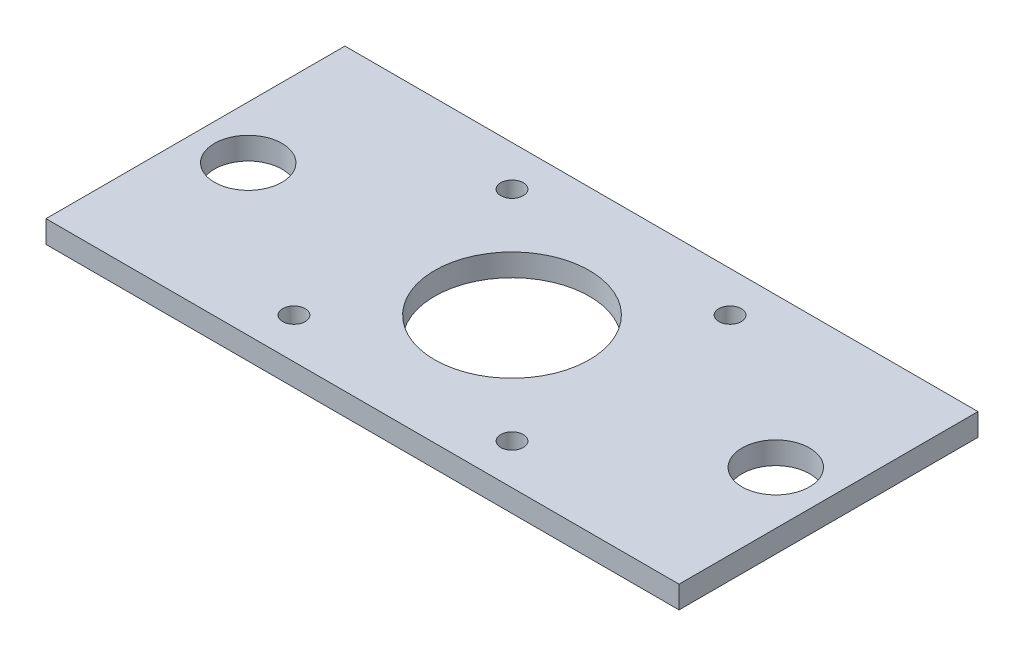
ISO-10303-21;
HEADER;
FILE_DESCRIPTION(('STEP AP214'),'2;1');
FILE_NAME('part.step','',(''),(''),'','','');
FILE_SCHEMA(('AUTOMOTIVE_DESIGN { 1 0 10303 214 1 1 1 1 }'));
ENDSEC;
DATA;
#1=APPLICATION_CONTEXT('core data for automotive mechanical design processes');
#2=APPLICATION_PROTOCOL_DEFINITION('international standard','automotive_design',2000,#1);
#3=PRODUCT_CONTEXT('',#1,'mechanical');
#4=PRODUCT('Part','Part','',(#3));
#5=PRODUCT_RELATED_PRODUCT_CATEGORY('part','',(#4));
#6=PRODUCT_DEFINITION_FORMATION('','',#4);
#7=PRODUCT_DEFINITION_CONTEXT('part definition',#1,'design');
#8=PRODUCT_DEFINITION('design','',#6,#7);
#9=PRODUCT_DEFINITION_SHAPE('','',#8);
#10=(LENGTH_UNIT() NAMED_UNIT(*) SI_UNIT(.MILLI.,.METRE.));
#11=(NAMED_UNIT(*) PLANE_ANGLE_UNIT() SI_UNIT($,.RADIAN.));
#12=(NAMED_UNIT(*) SI_UNIT($,.STERADIAN.) SOLID_ANGLE_UNIT());
#13=UNCERTAINTY_MEASURE_WITH_UNIT(LENGTH_MEASURE(1.E-05),#10,'distance_accuracy_value','');
#14=(GEOMETRIC_REPRESENTATION_CONTEXT(3) GLOBAL_UNCERTAINTY_ASSIGNED_CONTEXT((#13)) GLOBAL_UNIT_ASSIGNED_CONTEXT((#10,
#11,#12)) REPRESENTATION_CONTEXT('',''));
#15=CARTESIAN_POINT('',(0.,0.,0.));
#16=DIRECTION('',(0.,0.,1.));
#17=DIRECTION('',(1.,0.,0.));
#18=AXIS2_PLACEMENT_3D('',#15,#16,#17);
#19=CARTESIAN_POINT('',(0.,3.175,0.));
#20=DIRECTION('',(0.,-1.,0.));
#21=DIRECTION('',(0.,0.,-1.));
#22=AXIS2_PLACEMENT_3D('',#19,#20,#21);
#23=PLANE('',#22);
#24=DIRECTION('',(0.,0.,1.));
#25=VECTOR('',#24,1.);
#26=CARTESIAN_POINT('',(-45.,3.175,-21.25));
#27=LINE('',#26,#25);
#28=CARTESIAN_POINT('',(-45.,3.175,-21.25));
#29=VERTEX_POINT('',#28);
#30=CARTESIAN_POINT('',(-45.,3.175,21.25));
#31=VERTEX_POINT('',#30);
#32=EDGE_CURVE('E91',#29,#31,#27,.T.);
#33=ORIENTED_EDGE('',*,*,#32,.T.);
#34=DIRECTION('',(1.,0.,0.));
#35=VECTOR('',#34,1.);
#36=CARTESIAN_POINT('',(45.,3.175,21.25));
#37=LINE('',#36,#35);
#38=CARTESIAN_POINT('',(45.,3.175,21.25));
#39=VERTEX_POINT('',#38);
#40=EDGE_CURVE('E86',#31,#39,#37,.T.);
#41=ORIENTED_EDGE('',*,*,#40,.T.);
#42=DIRECTION('',(0.,0.,-1.));
#43=VECTOR('',#42,1.);
#44=CARTESIAN_POINT('',(45.,3.175,-21.25));
#45=LINE('',#44,#43);
#46=CARTESIAN_POINT('',(45.,3.175,-21.25));
#47=VERTEX_POINT('',#46);
#48=EDGE_CURVE('E89',#39,#47,#45,.T.);
#49=ORIENTED_EDGE('',*,*,#48,.T.);
#50=DIRECTION('',(-1.,0.,0.));
#51=VECTOR('',#50,1.);
#52=CARTESIAN_POINT('',(45.,3.175,-21.25));
#53=LINE('',#52,#51);
#54=EDGE_CURVE('E56',#47,#29,#53,.T.);
#55=ORIENTED_EDGE('',*,*,#54,.T.);
#56=EDGE_LOOP('',(#33,#41,#49,#55));
#57=FACE_BOUND('',#56,.T.);
#58=CARTESIAN_POINT('',(0.,3.175,0.));
#59=DIRECTION('',(0.,1.,0.));
#60=DIRECTION('',(0.,0.,1.));
#61=AXIS2_PLACEMENT_3D('',#58,#59,#60);
#62=CIRCLE('',#61,11.);
#63=CARTESIAN_POINT('',(0.,3.175,11.));
#64=VERTEX_POINT('',#63);
#65=EDGE_CURVE('E106',#64,#64,#62,.T.);
#66=ORIENTED_EDGE('',*,*,#65,.F.);
#67=EDGE_LOOP('',(#66));
#68=FACE_BOUND('',#67,.T.);
#69=CARTESIAN_POINT('',(-15.5,3.175,-15.5));
#70=DIRECTION('',(0.,1.,0.));
#71=DIRECTION('',(0.,0.,1.));
#72=AXIS2_PLACEMENT_3D('',#69,#70,#71);
#73=CIRCLE('',#72,1.6);
#74=CARTESIAN_POINT('',(-15.5,3.175,-13.9));
#75=VERTEX_POINT('',#74);
#76=EDGE_CURVE('E121',#75,#75,#73,.T.);
#77=ORIENTED_EDGE('',*,*,#76,.F.);
#78=EDGE_LOOP('',(#77));
#79=FACE_BOUND('',#78,.T.);
#80=CARTESIAN_POINT('',(15.5,3.175,-15.5));
#81=DIRECTION('',(0.,1.,0.));
#82=DIRECTION('',(0.,0.,1.));
#83=AXIS2_PLACEMENT_3D('',#80,#81,#82);
#84=CIRCLE('',#83,1.6);
#85=CARTESIAN_POINT('',(15.5,3.175,-13.9));
#86=VERTEX_POINT('',#85);
#87=EDGE_CURVE('E127',#86,#86,#84,.T.);
#88=ORIENTED_EDGE('',*,*,#87,.F.);
#89=EDGE_LOOP('',(#88));
#90=FACE_BOUND('',#89,.T.);
#91=CARTESIAN_POINT('',(15.5,3.175,15.5));
#92=DIRECTION('',(0.,1.,0.));
#93=DIRECTION('',(0.,0.,1.));
#94=AXIS2_PLACEMENT_3D('',#91,#92,#93);
#95=CIRCLE('',#94,1.6);
#96=CARTESIAN_POINT('',(15.5,3.175,17.1));
#97=VERTEX_POINT('',#96);
#98=EDGE_CURVE('E133',#97,#97,#95,.T.);
#99=ORIENTED_EDGE('',*,*,#98,.F.);
#100=EDGE_LOOP('',(#99));
#101=FACE_BOUND('',#100,.T.);
#102=CARTESIAN_POINT('',(-15.5,3.175,15.5));
#103=DIRECTION('',(0.,1.,0.));
#104=DIRECTION('',(0.,0.,1.));
#105=AXIS2_PLACEMENT_3D('',#102,#103,#104);
#106=CIRCLE('',#105,1.6);
#107=CARTESIAN_POINT('',(-15.5,3.175,17.1));
#108=VERTEX_POINT('',#107);
#109=EDGE_CURVE('E139',#108,#108,#106,.T.);
#110=ORIENTED_EDGE('',*,*,#109,.F.);
#111=EDGE_LOOP('',(#110));
#112=FACE_BOUND('',#111,.T.);
#113=CARTESIAN_POINT('',(-37.5,3.175,0.));
#114=DIRECTION('',(0.,1.,0.));
#115=DIRECTION('',(0.,0.,1.));
#116=AXIS2_PLACEMENT_3D('',#113,#114,#115);
#117=CIRCLE('',#116,4.79806);
#118=CARTESIAN_POINT('',(-37.5,3.175,4.79806));
#119=VERTEX_POINT('',#118);
#120=EDGE_CURVE('E145',#119,#119,#117,.T.);
#121=ORIENTED_EDGE('',*,*,#120,.F.);
#122=EDGE_LOOP('',(#121));
#123=FACE_BOUND('',#122,.T.);
#124=CARTESIAN_POINT('',(37.5,3.175,0.));
#125=DIRECTION('',(0.,1.,0.));
#126=DIRECTION('',(0.,0.,1.));
#127=AXIS2_PLACEMENT_3D('',#124,#125,#126);
#128=CIRCLE('',#127,4.79806);
#129=CARTESIAN_POINT('',(37.5,3.175,4.79805999999999));
#130=VERTEX_POINT('',#129);
#131=EDGE_CURVE('E151',#130,#130,#128,.T.);
#132=ORIENTED_EDGE('',*,*,#131,.F.);
#133=EDGE_LOOP('',(#132));
#134=FACE_BOUND('',#133,.T.);
#135=ADVANCED_FACE('F39',(#57,#68,#79,#90,#101,#112,#123,#134),#23,.F.);
#136=CARTESIAN_POINT('',(0.,0.,0.));
#137=DIRECTION('',(0.,-1.,0.));
#138=DIRECTION('',(0.,0.,-1.));
#139=AXIS2_PLACEMENT_3D('',#136,#137,#138);
#140=PLANE('',#139);
#141=CARTESIAN_POINT('',(-37.5,0.,0.));
#142=DIRECTION('',(0.,1.,0.));
#143=DIRECTION('',(0.,0.,1.));
#144=AXIS2_PLACEMENT_3D('',#141,#142,#143);
#145=CIRCLE('',#144,4.79806);
#146=CARTESIAN_POINT('',(-37.5,0.,4.79806));
#147=VERTEX_POINT('',#146);
#148=EDGE_CURVE('E148',#147,#147,#145,.T.);
#149=ORIENTED_EDGE('',*,*,#148,.T.);
#150=EDGE_LOOP('',(#149));
#151=FACE_BOUND('',#150,.T.);
#152=CARTESIAN_POINT('',(15.5,0.,15.5));
#153=DIRECTION('',(0.,1.,0.));
#154=DIRECTION('',(0.,0.,1.));
#155=AXIS2_PLACEMENT_3D('',#152,#153,#154);
#156=CIRCLE('',#155,1.6);
#157=CARTESIAN_POINT('',(15.5,0.,17.1));
#158=VERTEX_POINT('',#157);
#159=EDGE_CURVE('E136',#158,#158,#156,.T.);
#160=ORIENTED_EDGE('',*,*,#159,.T.);
#161=EDGE_LOOP('',(#160));
#162=FACE_BOUND('',#161,.T.);
#163=CARTESIAN_POINT('',(-15.5,0.,-15.5));
#164=DIRECTION('',(0.,1.,0.));
#165=DIRECTION('',(0.,0.,1.));
#166=AXIS2_PLACEMENT_3D('',#163,#164,#165);
#167=CIRCLE('',#166,1.6);
#168=CARTESIAN_POINT('',(-15.5,0.,-13.9));
#169=VERTEX_POINT('',#168);
#170=EDGE_CURVE('E124',#169,#169,#167,.T.);
#171=ORIENTED_EDGE('',*,*,#170,.T.);
#172=EDGE_LOOP('',(#171));
#173=FACE_BOUND('',#172,.T.);
#174=DIRECTION('',(0.,0.,1.));
#175=VECTOR('',#174,1.);
#176=CARTESIAN_POINT('',(-45.,0.,-21.25));
#177=LINE('',#176,#175);
#178=CARTESIAN_POINT('',(-45.,0.,-21.25));
#179=VERTEX_POINT('',#178);
#180=CARTESIAN_POINT('',(-45.,0.,21.25));
#181=VERTEX_POINT('',#180);
#182=EDGE_CURVE('E103',#179,#181,#177,.T.);
#183=ORIENTED_EDGE('',*,*,#182,.F.);
#184=DIRECTION('',(-1.,0.,0.));
#185=VECTOR('',#184,1.);
#186=CARTESIAN_POINT('',(45.,0.,-21.25));
#187=LINE('',#186,#185);
#188=CARTESIAN_POINT('',(45.,0.,-21.25));
#189=VERTEX_POINT('',#188);
#190=EDGE_CURVE('E79',#189,#179,#187,.T.);
#191=ORIENTED_EDGE('',*,*,#190,.F.);
#192=DIRECTION('',(0.,0.,-1.));
#193=VECTOR('',#192,1.);
#194=CARTESIAN_POINT('',(45.,0.,-21.25));
#195=LINE('',#194,#193);
#196=CARTESIAN_POINT('',(45.,0.,21.25));
#197=VERTEX_POINT('',#196);
#198=EDGE_CURVE('E73',#197,#189,#195,.T.);
#199=ORIENTED_EDGE('',*,*,#198,.F.);
#200=DIRECTION('',(1.,0.,0.));
#201=VECTOR('',#200,1.);
#202=CARTESIAN_POINT('',(45.,0.,21.25));
#203=LINE('',#202,#201);
#204=EDGE_CURVE('E95',#181,#197,#203,.T.);
#205=ORIENTED_EDGE('',*,*,#204,.F.);
#206=EDGE_LOOP('',(#183,#191,#199,#205));
#207=FACE_BOUND('',#206,.T.);
#208=CARTESIAN_POINT('',(0.,0.,0.));
#209=DIRECTION('',(0.,1.,0.));
#210=DIRECTION('',(0.,0.,1.));
#211=AXIS2_PLACEMENT_3D('',#208,#209,#210);
#212=CIRCLE('',#211,11.);
#213=CARTESIAN_POINT('',(0.,0.,11.));
#214=VERTEX_POINT('',#213);
#215=EDGE_CURVE('E118',#214,#214,#212,.T.);
#216=ORIENTED_EDGE('',*,*,#215,.T.);
#217=EDGE_LOOP('',(#216));
#218=FACE_BOUND('',#217,.T.);
#219=CARTESIAN_POINT('',(15.5,0.,-15.5));
#220=DIRECTION('',(0.,1.,0.));
#221=DIRECTION('',(0.,0.,1.));
#222=AXIS2_PLACEMENT_3D('',#219,#220,#221);
#223=CIRCLE('',#222,1.6);
#224=CARTESIAN_POINT('',(15.5,0.,-13.9));
#225=VERTEX_POINT('',#224);
#226=EDGE_CURVE('E130',#225,#225,#223,.T.);
#227=ORIENTED_EDGE('',*,*,#226,.T.);
#228=EDGE_LOOP('',(#227));
#229=FACE_BOUND('',#228,.T.);
#230=CARTESIAN_POINT('',(-15.5,0.,15.5));
#231=DIRECTION('',(0.,1.,0.));
#232=DIRECTION('',(0.,0.,1.));
#233=AXIS2_PLACEMENT_3D('',#230,#231,#232);
#234=CIRCLE('',#233,1.6);
#235=CARTESIAN_POINT('',(-15.5,0.,17.1));
#236=VERTEX_POINT('',#235);
#237=EDGE_CURVE('E142',#236,#236,#234,.T.);
#238=ORIENTED_EDGE('',*,*,#237,.T.);
#239=EDGE_LOOP('',(#238));
#240=FACE_BOUND('',#239,.T.);
#241=CARTESIAN_POINT('',(37.5,0.,0.));
#242=DIRECTION('',(0.,1.,0.));
#243=DIRECTION('',(0.,0.,1.));
#244=AXIS2_PLACEMENT_3D('',#241,#242,#243);
#245=CIRCLE('',#244,4.79806);
#246=CARTESIAN_POINT('',(37.5,0.,4.79805999999999));
#247=VERTEX_POINT('',#246);
#248=EDGE_CURVE('E154',#247,#247,#245,.T.);
#249=ORIENTED_EDGE('',*,*,#248,.T.);
#250=EDGE_LOOP('',(#249));
#251=FACE_BOUND('',#250,.T.);
#252=ADVANCED_FACE('F114',(#151,#162,#173,#207,#218,#229,#240,#251),#140,.T.);
#253=CARTESIAN_POINT('',(-45.,3.175,-21.25));
#254=DIRECTION('',(1.,0.,0.));
#255=DIRECTION('',(0.,0.,-1.));
#256=AXIS2_PLACEMENT_3D('',#253,#254,#255);
#257=PLANE('',#256);
#258=ORIENTED_EDGE('',*,*,#182,.T.);
#259=DIRECTION('',(0.,-1.,0.));
#260=VECTOR('',#259,1.);
#261=CARTESIAN_POINT('',(-45.,3.175,21.25));
#262=LINE('',#261,#260);
#263=EDGE_CURVE('E11',#31,#181,#262,.T.);
#264=ORIENTED_EDGE('',*,*,#263,.F.);
#265=ORIENTED_EDGE('',*,*,#32,.F.);
#266=DIRECTION('',(0.,-1.,0.));
#267=VECTOR('',#266,1.);
#268=CARTESIAN_POINT('',(-45.,3.175,-21.25));
#269=LINE('',#268,#267);
#270=EDGE_CURVE('E99',#29,#179,#269,.T.);
#271=ORIENTED_EDGE('',*,*,#270,.T.);
#272=EDGE_LOOP('',(#258,#264,#265,#271));
#273=FACE_BOUND('',#272,.T.);
#274=ADVANCED_FACE('F41',(#273),#257,.F.);
#275=CARTESIAN_POINT('',(45.,3.175,21.25));
#276=DIRECTION('',(0.,0.,-1.));
#277=DIRECTION('',(-1.,0.,0.));
#278=AXIS2_PLACEMENT_3D('',#275,#276,#277);
#279=PLANE('',#278);
#280=ORIENTED_EDGE('',*,*,#204,.T.);
#281=DIRECTION('',(0.,-1.,0.));
#282=VECTOR('',#281,1.);
#283=CARTESIAN_POINT('',(45.,3.175,21.25));
#284=LINE('',#283,#282);
#285=EDGE_CURVE('E48',#39,#197,#284,.T.);
#286=ORIENTED_EDGE('',*,*,#285,.F.);
#287=ORIENTED_EDGE('',*,*,#40,.F.);
#288=ORIENTED_EDGE('',*,*,#263,.T.);
#289=EDGE_LOOP('',(#280,#286,#287,#288));
#290=FACE_BOUND('',#289,.T.);
#291=ADVANCED_FACE('F94',(#290),#279,.F.);
#292=CARTESIAN_POINT('',(45.,3.175,-21.25));
#293=DIRECTION('',(-1.,0.,0.));
#294=DIRECTION('',(0.,0.,1.));
#295=AXIS2_PLACEMENT_3D('',#292,#293,#294);
#296=PLANE('',#295);
#297=ORIENTED_EDGE('',*,*,#198,.T.);
#298=DIRECTION('',(0.,-1.,0.));
#299=VECTOR('',#298,1.);
#300=CARTESIAN_POINT('',(45.,3.175,-21.25));
#301=LINE('',#300,#299);
#302=EDGE_CURVE('E96',#47,#189,#301,.T.);
#303=ORIENTED_EDGE('',*,*,#302,.F.);
#304=ORIENTED_EDGE('',*,*,#48,.F.);
#305=ORIENTED_EDGE('',*,*,#285,.T.);
#306=EDGE_LOOP('',(#297,#303,#304,#305));
#307=FACE_BOUND('',#306,.T.);
#308=ADVANCED_FACE('F97',(#307),#296,.F.);
#309=CARTESIAN_POINT('',(45.,3.175,-21.25));
#310=DIRECTION('',(0.,0.,1.));
#311=DIRECTION('',(1.,0.,0.));
#312=AXIS2_PLACEMENT_3D('',#309,#310,#311);
#313=PLANE('',#312);
#314=ORIENTED_EDGE('',*,*,#190,.T.);
#315=ORIENTED_EDGE('',*,*,#270,.F.);
#316=ORIENTED_EDGE('',*,*,#54,.F.);
#317=ORIENTED_EDGE('',*,*,#302,.T.);
#318=EDGE_LOOP('',(#314,#315,#316,#317));
#319=FACE_BOUND('',#318,.T.);
#320=ADVANCED_FACE('F111',(#319),#313,.F.);
#321=CARTESIAN_POINT('',(0.,3.175,0.));
#322=DIRECTION('',(0.,-1.,0.));
#323=DIRECTION('',(0.,0.,-1.));
#324=AXIS2_PLACEMENT_3D('',#321,#322,#323);
#325=CYLINDRICAL_SURFACE('',#324,11.);
#326=ORIENTED_EDGE('',*,*,#65,.T.);
#327=EDGE_LOOP('',(#326));
#328=FACE_BOUND('',#327,.T.);
#329=ORIENTED_EDGE('',*,*,#215,.F.);
#330=EDGE_LOOP('',(#329));
#331=FACE_BOUND('',#330,.T.);
#332=ADVANCED_FACE('F171',(#328,#331),#325,.F.);
#333=CARTESIAN_POINT('',(-15.5,3.175,-15.5));
#334=DIRECTION('',(0.,-1.,0.));
#335=DIRECTION('',(0.,0.,-1.));
#336=AXIS2_PLACEMENT_3D('',#333,#334,#335);
#337=CYLINDRICAL_SURFACE('',#336,1.6);
#338=ORIENTED_EDGE('',*,*,#76,.T.);
#339=EDGE_LOOP('',(#338));
#340=FACE_BOUND('',#339,.T.);
#341=ORIENTED_EDGE('',*,*,#170,.F.);
#342=EDGE_LOOP('',(#341));
#343=FACE_BOUND('',#342,.T.);
#344=ADVANCED_FACE('F216',(#340,#343),#337,.F.);
#345=CARTESIAN_POINT('',(15.5,3.175,-15.5));
#346=DIRECTION('',(0.,-1.,0.));
#347=DIRECTION('',(0.,0.,-1.));
#348=AXIS2_PLACEMENT_3D('',#345,#346,#347);
#349=CYLINDRICAL_SURFACE('',#348,1.6);
#350=ORIENTED_EDGE('',*,*,#87,.T.);
#351=EDGE_LOOP('',(#350));
#352=FACE_BOUND('',#351,.T.);
#353=ORIENTED_EDGE('',*,*,#226,.F.);
#354=EDGE_LOOP('',(#353));
#355=FACE_BOUND('',#354,.T.);
#356=ADVANCED_FACE('F224',(#352,#355),#349,.F.);
#357=CARTESIAN_POINT('',(15.5,3.175,15.5));
#358=DIRECTION('',(0.,-1.,0.));
#359=DIRECTION('',(0.,0.,-1.));
#360=AXIS2_PLACEMENT_3D('',#357,#358,#359);
#361=CYLINDRICAL_SURFACE('',#360,1.6);
#362=ORIENTED_EDGE('',*,*,#98,.T.);
#363=EDGE_LOOP('',(#362));
#364=FACE_BOUND('',#363,.T.);
#365=ORIENTED_EDGE('',*,*,#159,.F.);
#366=EDGE_LOOP('',(#365));
#367=FACE_BOUND('',#366,.T.);
#368=ADVANCED_FACE('F232',(#364,#367),#361,.F.);
#369=CARTESIAN_POINT('',(-15.5,3.175,15.5));
#370=DIRECTION('',(0.,-1.,0.));
#371=DIRECTION('',(0.,0.,-1.));
#372=AXIS2_PLACEMENT_3D('',#369,#370,#371);
#373=CYLINDRICAL_SURFACE('',#372,1.6);
#374=ORIENTED_EDGE('',*,*,#109,.T.);
#375=EDGE_LOOP('',(#374));
#376=FACE_BOUND('',#375,.T.);
#377=ORIENTED_EDGE('',*,*,#237,.F.);
#378=EDGE_LOOP('',(#377));
#379=FACE_BOUND('',#378,.T.);
#380=ADVANCED_FACE('F241',(#376,#379),#373,.F.);
#381=CARTESIAN_POINT('',(-37.5,3.175,0.));
#382=DIRECTION('',(0.,-1.,0.));
#383=DIRECTION('',(0.,0.,-1.));
#384=AXIS2_PLACEMENT_3D('',#381,#382,#383);
#385=CYLINDRICAL_SURFACE('',#384,4.79806);
#386=ORIENTED_EDGE('',*,*,#120,.T.);
#387=EDGE_LOOP('',(#386));
#388=FACE_BOUND('',#387,.T.);
#389=ORIENTED_EDGE('',*,*,#148,.F.);
#390=EDGE_LOOP('',(#389));
#391=FACE_BOUND('',#390,.T.);
#392=ADVANCED_FACE('F250',(#388,#391),#385,.F.);
#393=CARTESIAN_POINT('',(37.5,3.175,0.));
#394=DIRECTION('',(0.,-1.,0.));
#395=DIRECTION('',(0.,0.,-1.));
#396=AXIS2_PLACEMENT_3D('',#393,#394,#395);
#397=CYLINDRICAL_SURFACE('',#396,4.79806);
#398=ORIENTED_EDGE('',*,*,#131,.T.);
#399=EDGE_LOOP('',(#398));
#400=FACE_BOUND('',#399,.T.);
#401=ORIENTED_EDGE('',*,*,#248,.F.);
#402=EDGE_LOOP('',(#401));
#403=FACE_BOUND('',#402,.T.);
#404=ADVANCED_FACE('F160',(#400,#403),#397,.F.);
#405=CLOSED_SHELL('',(#135,#252,#274,#291,#308,#320,#332,#344,#356,#368,#380,#392,#404));
#406=MANIFOLD_SOLID_BREP('B2',#405);
#407=ADVANCED_BREP_SHAPE_REPRESENTATION('',(#18,#406),#14);
#408=SHAPE_DEFINITION_REPRESENTATION(#9,#407);
ENDSEC;
END-ISO-10303-21;
